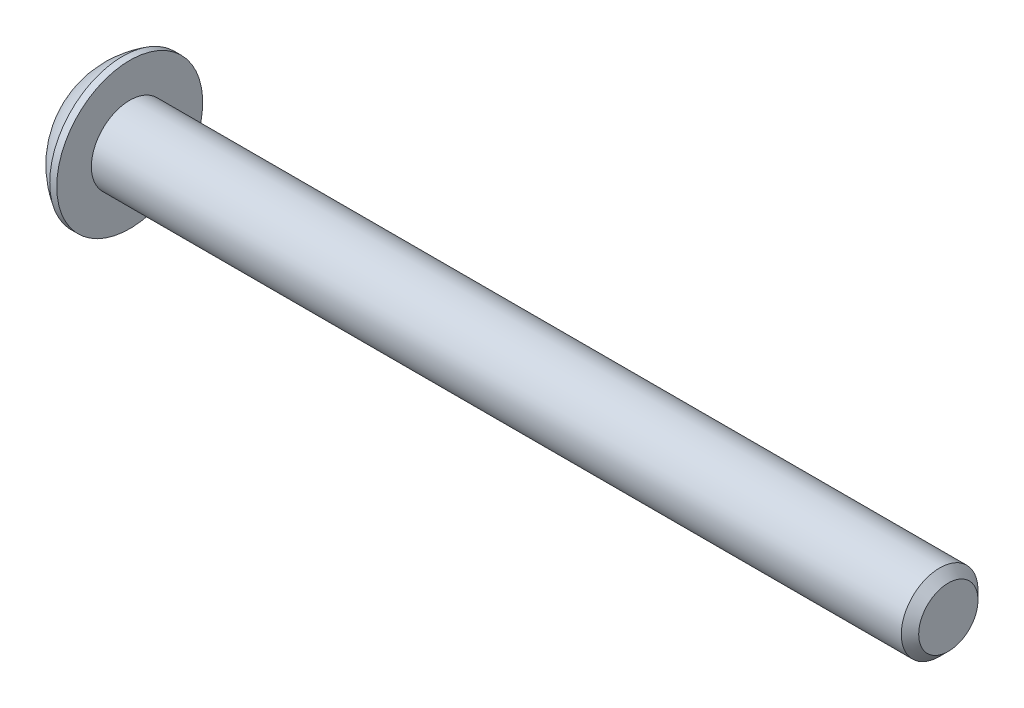
ISO-10303-21;
HEADER;
FILE_DESCRIPTION(('STEP AP214'),'2;1');
FILE_NAME('part.step','',(''),(''),'','','');
FILE_SCHEMA(('AUTOMOTIVE_DESIGN { 1 0 10303 214 1 1 1 1 }'));
ENDSEC;
DATA;
#1=APPLICATION_CONTEXT('core data for automotive mechanical design processes');
#2=APPLICATION_PROTOCOL_DEFINITION('international standard','automotive_design',2000,#1);
#3=PRODUCT_CONTEXT('',#1,'mechanical');
#4=PRODUCT('Part','Part','',(#3));
#5=PRODUCT_RELATED_PRODUCT_CATEGORY('part','',(#4));
#6=PRODUCT_DEFINITION_FORMATION('','',#4);
#7=PRODUCT_DEFINITION_CONTEXT('part definition',#1,'design');
#8=PRODUCT_DEFINITION('design','',#6,#7);
#9=PRODUCT_DEFINITION_SHAPE('','',#8);
#10=(LENGTH_UNIT() NAMED_UNIT(*) SI_UNIT(.MILLI.,.METRE.));
#11=(NAMED_UNIT(*) PLANE_ANGLE_UNIT() SI_UNIT($,.RADIAN.));
#12=(NAMED_UNIT(*) SI_UNIT($,.STERADIAN.) SOLID_ANGLE_UNIT());
#13=UNCERTAINTY_MEASURE_WITH_UNIT(LENGTH_MEASURE(1.E-05),#10,'distance_accuracy_value','');
#14=(GEOMETRIC_REPRESENTATION_CONTEXT(3) GLOBAL_UNCERTAINTY_ASSIGNED_CONTEXT((#13)) GLOBAL_UNIT_ASSIGNED_CONTEXT((#10,
#11,#12)) REPRESENTATION_CONTEXT('',''));
#15=CARTESIAN_POINT('',(0.,0.,0.));
#16=DIRECTION('',(0.,0.,1.));
#17=DIRECTION('',(1.,0.,0.));
#18=AXIS2_PLACEMENT_3D('',#15,#16,#17);
#19=CARTESIAN_POINT('',(1.32080000000034,0.,0.));
#20=DIRECTION('',(-1.,0.,0.));
#21=DIRECTION('',(0.,0.,1.));
#22=AXIS2_PLACEMENT_3D('',#19,#20,#21);
#23=CONICAL_SURFACE('',#22,1.1937999999998,1.04719755119608);
#24=CARTESIAN_POINT('',(2.01004075135902,0.,4.44089209850063E-13));
#25=VERTEX_POINT('',#24);
#26=VERTEX_LOOP('',#25);
#27=FACE_BOUND('',#26,.T.);
#28=CARTESIAN_POINT('',(1.32080000000009,0.,0.));
#29=DIRECTION('',(-1.,0.,0.));
#30=DIRECTION('',(0.,0.,1.));
#31=AXIS2_PLACEMENT_3D('',#28,#29,#30);
#32=CIRCLE('',#31,1.19380000000024);
#33=CARTESIAN_POINT('',(1.32080000000004,-1.03386112703797,0.596900000000061));
#34=VERTEX_POINT('',#33);
#35=CARTESIAN_POINT('',(1.32080000000004,0.,1.19380000000012));
#36=VERTEX_POINT('',#35);
#37=EDGE_CURVE('E19',#34,#36,#32,.T.);
#38=ORIENTED_EDGE('',*,*,#37,.T.);
#39=CARTESIAN_POINT('',(1.32080000000009,0.,0.));
#40=DIRECTION('',(-1.,0.,0.));
#41=DIRECTION('',(0.,0.,1.));
#42=AXIS2_PLACEMENT_3D('',#39,#40,#41);
#43=CIRCLE('',#42,1.19380000000024);
#44=CARTESIAN_POINT('',(1.32080000000004,1.03386112703797,0.59690000000006));
#45=VERTEX_POINT('',#44);
#46=EDGE_CURVE('E147',#36,#45,#43,.T.);
#47=ORIENTED_EDGE('',*,*,#46,.T.);
#48=CARTESIAN_POINT('',(1.32080000000009,0.,0.));
#49=DIRECTION('',(-1.,0.,0.));
#50=DIRECTION('',(0.,0.,1.));
#51=AXIS2_PLACEMENT_3D('',#48,#49,#50);
#52=CIRCLE('',#51,1.19380000000024);
#53=CARTESIAN_POINT('',(1.32080000000004,1.03386112703797,-0.59690000000006));
#54=VERTEX_POINT('',#53);
#55=EDGE_CURVE('E449',#45,#54,#52,.T.);
#56=ORIENTED_EDGE('',*,*,#55,.T.);
#57=CARTESIAN_POINT('',(1.32080000000009,0.,0.));
#58=DIRECTION('',(-1.,0.,0.));
#59=DIRECTION('',(0.,0.,1.));
#60=AXIS2_PLACEMENT_3D('',#57,#58,#59);
#61=CIRCLE('',#60,1.19380000000024);
#62=CARTESIAN_POINT('',(1.32080000000004,1.49457637585666E-12,-1.19380000000012));
#63=VERTEX_POINT('',#62);
#64=EDGE_CURVE('E450',#54,#63,#61,.T.);
#65=ORIENTED_EDGE('',*,*,#64,.T.);
#66=CARTESIAN_POINT('',(1.32080000000009,0.,0.));
#67=DIRECTION('',(-1.,0.,0.));
#68=DIRECTION('',(0.,0.,1.));
#69=AXIS2_PLACEMENT_3D('',#66,#67,#68);
#70=CIRCLE('',#69,1.19380000000024);
#71=CARTESIAN_POINT('',(1.32080000000004,-1.03386112703797,-0.596900000000061));
#72=VERTEX_POINT('',#71);
#73=EDGE_CURVE('E92',#63,#72,#70,.T.);
#74=ORIENTED_EDGE('',*,*,#73,.T.);
#75=CARTESIAN_POINT('',(1.32080000000009,0.,0.));
#76=DIRECTION('',(-1.,0.,0.));
#77=DIRECTION('',(0.,0.,1.));
#78=AXIS2_PLACEMENT_3D('',#75,#76,#77);
#79=CIRCLE('',#78,1.19380000000024);
#80=EDGE_CURVE('E88',#72,#34,#79,.T.);
#81=ORIENTED_EDGE('',*,*,#80,.T.);
#82=EDGE_LOOP('',(#38,#47,#56,#65,#74,#81));
#83=FACE_BOUND('',#82,.T.);
#84=ADVANCED_FACE('F16',(#27,#83),#23,.F.);
#85=CARTESIAN_POINT('',(1.3208,-2.06772225407573,-1.1938));
#86=DIRECTION('',(1.,0.,0.));
#87=DIRECTION('',(0.,0.,-1.));
#88=AXIS2_PLACEMENT_3D('',#85,#86,#87);
#89=PLANE('',#88);
#90=DIRECTION('',(0.,0.5,0.866025403784439));
#91=VECTOR('',#90,1.);
#92=CARTESIAN_POINT('',(1.3208,-1.37848150271715,0.));
#93=LINE('',#92,#91);
#94=CARTESIAN_POINT('',(1.3208,-0.689240751358575,1.1938));
#95=VERTEX_POINT('',#94);
#96=EDGE_CURVE('E100',#95,#34,#93,.F.);
#97=ORIENTED_EDGE('',*,*,#96,.F.);
#98=DIRECTION('',(0.,1.,0.));
#99=VECTOR('',#98,1.);
#100=CARTESIAN_POINT('',(1.3208,-0.689240751358575,1.1938));
#101=LINE('',#100,#99);
#102=EDGE_CURVE('E102',#36,#95,#101,.F.);
#103=ORIENTED_EDGE('',*,*,#102,.F.);
#104=ORIENTED_EDGE('',*,*,#37,.F.);
#105=EDGE_LOOP('',(#97,#103,#104));
#106=FACE_BOUND('',#105,.T.);
#107=ADVANCED_FACE('F98',(#106),#89,.F.);
#108=CARTESIAN_POINT('',(1.3208,-2.06772225407573,-1.1938));
#109=DIRECTION('',(1.,0.,0.));
#110=DIRECTION('',(0.,0.,-1.));
#111=AXIS2_PLACEMENT_3D('',#108,#109,#110);
#112=PLANE('',#111);
#113=DIRECTION('',(0.,-0.5,0.866025403784439));
#114=VECTOR('',#113,1.);
#115=CARTESIAN_POINT('',(1.3208,-0.689240751358575,-1.1938));
#116=LINE('',#115,#114);
#117=CARTESIAN_POINT('',(1.3208,-1.37848150271715,0.));
#118=VERTEX_POINT('',#117);
#119=EDGE_CURVE('E108',#118,#72,#116,.F.);
#120=ORIENTED_EDGE('',*,*,#119,.F.);
#121=DIRECTION('',(0.,0.5,0.866025403784439));
#122=VECTOR('',#121,1.);
#123=CARTESIAN_POINT('',(1.3208,-1.37848150271715,0.));
#124=LINE('',#123,#122);
#125=EDGE_CURVE('E105',#34,#118,#124,.F.);
#126=ORIENTED_EDGE('',*,*,#125,.F.);
#127=ORIENTED_EDGE('',*,*,#80,.F.);
#128=EDGE_LOOP('',(#120,#126,#127));
#129=FACE_BOUND('',#128,.T.);
#130=ADVANCED_FACE('F106',(#129),#112,.F.);
#131=CARTESIAN_POINT('',(1.3208,-2.06772225407573,-1.1938));
#132=DIRECTION('',(1.,0.,0.));
#133=DIRECTION('',(0.,0.,-1.));
#134=AXIS2_PLACEMENT_3D('',#131,#132,#133);
#135=PLANE('',#134);
#136=DIRECTION('',(0.,1.,0.));
#137=VECTOR('',#136,1.);
#138=CARTESIAN_POINT('',(1.3208,0.689240751358575,-1.1938));
#139=LINE('',#138,#137);
#140=CARTESIAN_POINT('',(1.3208,-0.689240751358575,-1.1938));
#141=VERTEX_POINT('',#140);
#142=EDGE_CURVE('E420',#141,#63,#139,.T.);
#143=ORIENTED_EDGE('',*,*,#142,.F.);
#144=DIRECTION('',(0.,-0.5,0.866025403784439));
#145=VECTOR('',#144,1.);
#146=CARTESIAN_POINT('',(1.3208,-0.689240751358575,-1.1938));
#147=LINE('',#146,#145);
#148=EDGE_CURVE('E432',#72,#141,#147,.F.);
#149=ORIENTED_EDGE('',*,*,#148,.F.);
#150=ORIENTED_EDGE('',*,*,#73,.F.);
#151=EDGE_LOOP('',(#143,#149,#150));
#152=FACE_BOUND('',#151,.T.);
#153=ADVANCED_FACE('F190',(#152),#135,.F.);
#154=CARTESIAN_POINT('',(1.3208,-2.06772225407573,-1.1938));
#155=DIRECTION('',(1.,0.,0.));
#156=DIRECTION('',(0.,0.,-1.));
#157=AXIS2_PLACEMENT_3D('',#154,#155,#156);
#158=PLANE('',#157);
#159=DIRECTION('',(0.,-0.499999999999999,-0.866025403784439));
#160=VECTOR('',#159,1.);
#161=CARTESIAN_POINT('',(1.3208,1.37848150271715,0.));
#162=LINE('',#161,#160);
#163=CARTESIAN_POINT('',(1.3208,0.689240751358575,-1.1938));
#164=VERTEX_POINT('',#163);
#165=EDGE_CURVE('E406',#164,#54,#162,.F.);
#166=ORIENTED_EDGE('',*,*,#165,.F.);
#167=DIRECTION('',(0.,1.,0.));
#168=VECTOR('',#167,1.);
#169=CARTESIAN_POINT('',(1.3208,0.689240751358575,-1.1938));
#170=LINE('',#169,#168);
#171=EDGE_CURVE('E417',#63,#164,#170,.T.);
#172=ORIENTED_EDGE('',*,*,#171,.F.);
#173=ORIENTED_EDGE('',*,*,#64,.F.);
#174=EDGE_LOOP('',(#166,#172,#173));
#175=FACE_BOUND('',#174,.T.);
#176=ADVANCED_FACE('F186',(#175),#158,.F.);
#177=CARTESIAN_POINT('',(1.3208,-2.06772225407573,-1.1938));
#178=DIRECTION('',(1.,0.,0.));
#179=DIRECTION('',(0.,0.,-1.));
#180=AXIS2_PLACEMENT_3D('',#177,#178,#179);
#181=PLANE('',#180);
#182=DIRECTION('',(0.,0.499999999999999,-0.866025403784439));
#183=VECTOR('',#182,1.);
#184=CARTESIAN_POINT('',(1.3208,0.689240751358575,1.1938));
#185=LINE('',#184,#183);
#186=CARTESIAN_POINT('',(1.3208,1.37848150271715,0.));
#187=VERTEX_POINT('',#186);
#188=EDGE_CURVE('E385',#187,#45,#185,.F.);
#189=ORIENTED_EDGE('',*,*,#188,.F.);
#190=DIRECTION('',(0.,-0.499999999999999,-0.866025403784439));
#191=VECTOR('',#190,1.);
#192=CARTESIAN_POINT('',(1.3208,1.37848150271715,0.));
#193=LINE('',#192,#191);
#194=EDGE_CURVE('E404',#54,#187,#193,.F.);
#195=ORIENTED_EDGE('',*,*,#194,.F.);
#196=ORIENTED_EDGE('',*,*,#55,.F.);
#197=EDGE_LOOP('',(#189,#195,#196));
#198=FACE_BOUND('',#197,.T.);
#199=ADVANCED_FACE('F182',(#198),#181,.F.);
#200=CARTESIAN_POINT('',(1.3208,-2.06772225407573,-1.1938));
#201=DIRECTION('',(1.,0.,0.));
#202=DIRECTION('',(0.,0.,-1.));
#203=AXIS2_PLACEMENT_3D('',#200,#201,#202);
#204=PLANE('',#203);
#205=DIRECTION('',(0.,1.,0.));
#206=VECTOR('',#205,1.);
#207=CARTESIAN_POINT('',(1.3208,-0.689240751358575,1.1938));
#208=LINE('',#207,#206);
#209=CARTESIAN_POINT('',(1.3208,0.689240751358575,1.1938));
#210=VERTEX_POINT('',#209);
#211=EDGE_CURVE('E117',#210,#36,#208,.F.);
#212=ORIENTED_EDGE('',*,*,#211,.F.);
#213=DIRECTION('',(0.,0.499999999999999,-0.866025403784439));
#214=VECTOR('',#213,1.);
#215=CARTESIAN_POINT('',(1.3208,0.689240751358575,1.1938));
#216=LINE('',#215,#214);
#217=EDGE_CURVE('E388',#45,#210,#216,.F.);
#218=ORIENTED_EDGE('',*,*,#217,.F.);
#219=ORIENTED_EDGE('',*,*,#46,.F.);
#220=EDGE_LOOP('',(#212,#218,#219));
#221=FACE_BOUND('',#220,.T.);
#222=ADVANCED_FACE('F178',(#221),#204,.F.);
#223=CARTESIAN_POINT('',(1.3208,-0.689240751358575,1.1938));
#224=DIRECTION('',(0.,0.,-1.));
#225=DIRECTION('',(0.,1.,0.));
#226=AXIS2_PLACEMENT_3D('',#223,#224,#225);
#227=PLANE('',#226);
#228=DIRECTION('',(0.,1.,0.));
#229=VECTOR('',#228,1.);
#230=CARTESIAN_POINT('',(0.,0.,1.1938));
#231=LINE('',#230,#229);
#232=CARTESIAN_POINT('',(0.,0.689240751358575,1.1938));
#233=VERTEX_POINT('',#232);
#234=CARTESIAN_POINT('',(0.,-0.689240751358575,1.1938));
#235=VERTEX_POINT('',#234);
#236=EDGE_CURVE('E382',#233,#235,#231,.F.);
#237=ORIENTED_EDGE('',*,*,#236,.F.);
#238=DIRECTION('',(1.,0.,0.));
#239=VECTOR('',#238,1.);
#240=CARTESIAN_POINT('',(1.3208,0.689240751358575,1.1938));
#241=LINE('',#240,#239);
#242=EDGE_CURVE('E394',#210,#233,#241,.F.);
#243=ORIENTED_EDGE('',*,*,#242,.F.);
#244=ORIENTED_EDGE('',*,*,#211,.T.);
#245=ORIENTED_EDGE('',*,*,#102,.T.);
#246=DIRECTION('',(1.,0.,0.));
#247=VECTOR('',#246,1.);
#248=CARTESIAN_POINT('',(1.3208,-0.689240751358575,1.1938));
#249=LINE('',#248,#247);
#250=EDGE_CURVE('E111',#235,#95,#249,.T.);
#251=ORIENTED_EDGE('',*,*,#250,.F.);
#252=EDGE_LOOP('',(#237,#243,#244,#245,#251));
#253=FACE_BOUND('',#252,.T.);
#254=ADVANCED_FACE('F175',(#253),#227,.T.);
#255=CARTESIAN_POINT('',(1.3208,-1.37848150271715,0.));
#256=DIRECTION('',(0.,0.866025403784439,-0.5));
#257=DIRECTION('',(0.,0.5,0.866025403784439));
#258=AXIS2_PLACEMENT_3D('',#255,#256,#257);
#259=PLANE('',#258);
#260=DIRECTION('',(0.,-0.5,-0.866025403784439));
#261=VECTOR('',#260,1.);
#262=CARTESIAN_POINT('',(0.,-0.689240751358575,1.1938));
#263=LINE('',#262,#261);
#264=CARTESIAN_POINT('',(0.,-1.37848150271715,0.));
#265=VERTEX_POINT('',#264);
#266=EDGE_CURVE('E379',#235,#265,#263,.T.);
#267=ORIENTED_EDGE('',*,*,#266,.F.);
#268=ORIENTED_EDGE('',*,*,#250,.T.);
#269=ORIENTED_EDGE('',*,*,#96,.T.);
#270=ORIENTED_EDGE('',*,*,#125,.T.);
#271=DIRECTION('',(1.,0.,0.));
#272=VECTOR('',#271,1.);
#273=CARTESIAN_POINT('',(1.3208,-1.37848150271715,0.));
#274=LINE('',#273,#272);
#275=EDGE_CURVE('E429',#265,#118,#274,.T.);
#276=ORIENTED_EDGE('',*,*,#275,.F.);
#277=EDGE_LOOP('',(#267,#268,#269,#270,#276));
#278=FACE_BOUND('',#277,.T.);
#279=ADVANCED_FACE('F115',(#278),#259,.T.);
#280=CARTESIAN_POINT('',(1.3208,-0.689240751358575,-1.1938));
#281=DIRECTION('',(0.,0.866025403784439,0.5));
#282=DIRECTION('',(0.,-0.5,0.866025403784439));
#283=AXIS2_PLACEMENT_3D('',#280,#281,#282);
#284=PLANE('',#283);
#285=DIRECTION('',(0.,0.5,-0.866025403784439));
#286=VECTOR('',#285,1.);
#287=CARTESIAN_POINT('',(0.,-1.37848150271715,0.));
#288=LINE('',#287,#286);
#289=CARTESIAN_POINT('',(0.,-0.689240751358575,-1.1938));
#290=VERTEX_POINT('',#289);
#291=EDGE_CURVE('E376',#265,#290,#288,.T.);
#292=ORIENTED_EDGE('',*,*,#291,.F.);
#293=ORIENTED_EDGE('',*,*,#275,.T.);
#294=ORIENTED_EDGE('',*,*,#119,.T.);
#295=ORIENTED_EDGE('',*,*,#148,.T.);
#296=DIRECTION('',(1.,0.,0.));
#297=VECTOR('',#296,1.);
#298=CARTESIAN_POINT('',(1.3208,-0.689240751358575,-1.1938));
#299=LINE('',#298,#297);
#300=EDGE_CURVE('E414',#290,#141,#299,.T.);
#301=ORIENTED_EDGE('',*,*,#300,.F.);
#302=EDGE_LOOP('',(#292,#293,#294,#295,#301));
#303=FACE_BOUND('',#302,.T.);
#304=ADVANCED_FACE('F168',(#303),#284,.T.);
#305=CARTESIAN_POINT('',(1.3208,0.689240751358575,-1.1938));
#306=DIRECTION('',(0.,0.,1.));
#307=DIRECTION('',(1.,0.,0.));
#308=AXIS2_PLACEMENT_3D('',#305,#306,#307);
#309=PLANE('',#308);
#310=DIRECTION('',(0.,1.,0.));
#311=VECTOR('',#310,1.);
#312=CARTESIAN_POINT('',(0.,0.,-1.1938));
#313=LINE('',#312,#311);
#314=CARTESIAN_POINT('',(0.,0.689240751358575,-1.1938));
#315=VERTEX_POINT('',#314);
#316=EDGE_CURVE('E373',#290,#315,#313,.T.);
#317=ORIENTED_EDGE('',*,*,#316,.F.);
#318=ORIENTED_EDGE('',*,*,#300,.T.);
#319=ORIENTED_EDGE('',*,*,#142,.T.);
#320=ORIENTED_EDGE('',*,*,#171,.T.);
#321=DIRECTION('',(1.,0.,0.));
#322=VECTOR('',#321,1.);
#323=CARTESIAN_POINT('',(1.3208,0.689240751358575,-1.1938));
#324=LINE('',#323,#322);
#325=EDGE_CURVE('E389',#315,#164,#324,.T.);
#326=ORIENTED_EDGE('',*,*,#325,.F.);
#327=EDGE_LOOP('',(#317,#318,#319,#320,#326));
#328=FACE_BOUND('',#327,.T.);
#329=ADVANCED_FACE('F165',(#328),#309,.T.);
#330=CARTESIAN_POINT('',(1.3208,1.37848150271715,0.));
#331=DIRECTION('',(0.,-0.866025403784439,0.499999999999999));
#332=DIRECTION('',(0.,-0.499999999999999,-0.866025403784439));
#333=AXIS2_PLACEMENT_3D('',#330,#331,#332);
#334=PLANE('',#333);
#335=DIRECTION('',(0.,0.499999999999999,0.866025403784439));
#336=VECTOR('',#335,1.);
#337=CARTESIAN_POINT('',(0.,0.689240751358575,-1.1938));
#338=LINE('',#337,#336);
#339=CARTESIAN_POINT('',(0.,1.37848150271715,0.));
#340=VERTEX_POINT('',#339);
#341=EDGE_CURVE('E370',#315,#340,#338,.T.);
#342=ORIENTED_EDGE('',*,*,#341,.F.);
#343=ORIENTED_EDGE('',*,*,#325,.T.);
#344=ORIENTED_EDGE('',*,*,#165,.T.);
#345=ORIENTED_EDGE('',*,*,#194,.T.);
#346=DIRECTION('',(1.,0.,0.));
#347=VECTOR('',#346,1.);
#348=CARTESIAN_POINT('',(1.3208,1.37848150271715,0.));
#349=LINE('',#348,#347);
#350=EDGE_CURVE('E34',#340,#187,#349,.T.);
#351=ORIENTED_EDGE('',*,*,#350,.F.);
#352=EDGE_LOOP('',(#342,#343,#344,#345,#351));
#353=FACE_BOUND('',#352,.T.);
#354=ADVANCED_FACE('F161',(#353),#334,.T.);
#355=CARTESIAN_POINT('',(1.3208,0.689240751358575,1.1938));
#356=DIRECTION('',(0.,-0.866025403784439,-0.499999999999999));
#357=DIRECTION('',(0.,0.499999999999999,-0.866025403784439));
#358=AXIS2_PLACEMENT_3D('',#355,#356,#357);
#359=PLANE('',#358);
#360=DIRECTION('',(0.,-0.499999999999999,0.866025403784439));
#361=VECTOR('',#360,1.);
#362=CARTESIAN_POINT('',(0.,1.37848150271715,0.));
#363=LINE('',#362,#361);
#364=EDGE_CURVE('E146',#340,#233,#363,.T.);
#365=ORIENTED_EDGE('',*,*,#364,.F.);
#366=ORIENTED_EDGE('',*,*,#350,.T.);
#367=ORIENTED_EDGE('',*,*,#188,.T.);
#368=ORIENTED_EDGE('',*,*,#217,.T.);
#369=ORIENTED_EDGE('',*,*,#242,.T.);
#370=EDGE_LOOP('',(#365,#366,#367,#368,#369));
#371=FACE_BOUND('',#370,.T.);
#372=ADVANCED_FACE('F157',(#371),#359,.T.);
#373=CARTESIAN_POINT('',(0.,0.,0.));
#374=DIRECTION('',(-1.,0.,0.));
#375=DIRECTION('',(0.,0.,1.));
#376=AXIS2_PLACEMENT_3D('',#373,#374,#375);
#377=PLANE('',#376);
#378=ORIENTED_EDGE('',*,*,#341,.T.);
#379=ORIENTED_EDGE('',*,*,#364,.T.);
#380=ORIENTED_EDGE('',*,*,#236,.T.);
#381=ORIENTED_EDGE('',*,*,#266,.T.);
#382=ORIENTED_EDGE('',*,*,#291,.T.);
#383=ORIENTED_EDGE('',*,*,#316,.T.);
#384=EDGE_LOOP('',(#378,#379,#380,#381,#382,#383));
#385=FACE_BOUND('',#384,.T.);
#386=CARTESIAN_POINT('',(0.,1.9812,0.));
#387=CARTESIAN_POINT('',(0.,1.9811996664299,0.0556258831179427));
#388=CARTESIAN_POINT('',(0.,1.97885520380442,0.111261989398606));
#389=CARTESIAN_POINT('',(0.,1.96949260169541,0.222149719830457));
#390=CARTESIAN_POINT('',(0.,1.96247308239605,0.277401225602895));
#391=CARTESIAN_POINT('',(0.,1.94379192841038,0.387209508139748));
#392=CARTESIAN_POINT('',(-1.85684713606366E-13,1.93212292489526,0.441765039546365));
#393=CARTESIAN_POINT('',(1.86703426467969E-13,1.90422331175315,0.549729449347493));
#394=CARTESIAN_POINT('',(6.95912300261454E-13,1.88798900035338,0.60313735920887));
#395=CARTESIAN_POINT('',(1.15748432216766E-12,1.83266214476501,0.760839131321829));
#396=CARTESIAN_POINT('',(0.,1.78690023648845,0.862876433575429));
#397=CARTESIAN_POINT('',(0.,1.67887358150667,1.05780719540872));
#398=CARTESIAN_POINT('',(9.54133844997183E-13,1.6166082074585,1.15070030720801));
#399=CARTESIAN_POINT('',(5.94835315740768E-13,1.51224157140982,1.28116890915698));
#400=CARTESIAN_POINT('',(1.63152335675163E-13,1.4755970394354,1.32320451127027));
#401=CARTESIAN_POINT('',(-1.62128088646011E-13,1.39893832619713,1.40400288695709));
#402=CARTESIAN_POINT('',(0.,1.35892742784699,1.44276877695455));
#403=CARTESIAN_POINT('',(1.13752532132066E-13,1.23416504602197,1.55382272417904));
#404=CARTESIAN_POINT('',(0.,1.14466125559859,1.62089527952111));
#405=CARTESIAN_POINT('',(0.,0.95571214417816,1.73902218081179));
#406=CARTESIAN_POINT('',(0.,0.856267198233559,1.79007713076007));
#407=CARTESIAN_POINT('',(0.,0.650206345910839,1.87477637530954));
#408=CARTESIAN_POINT('',(0.,0.543590516134851,1.90842085586267));
#409=CARTESIAN_POINT('',(0.,0.326226155292014,1.95733039300656));
#410=CARTESIAN_POINT('',(0.,0.215477602157926,1.97259535144288));
#411=CARTESIAN_POINT('',(0.,-0.00701040587545038,1.98431697865418));
#412=CARTESIAN_POINT('',(0.,-0.118749860774738,1.98077364742917));
#413=CARTESIAN_POINT('',(0.,-0.340050178355489,1.95497485623825));
#414=CARTESIAN_POINT('',(0.,-0.449611052668259,1.93271949620218));
#415=CARTESIAN_POINT('',(0.,-0.663431110729178,1.87014138774524));
#416=CARTESIAN_POINT('',(0.,-0.767690237838526,1.82981844635272));
#417=CARTESIAN_POINT('',(0.,-0.968005760719351,1.73219968377097));
#418=CARTESIAN_POINT('',(0.,-1.0640618469811,1.6749032225164));
#419=CARTESIAN_POINT('',(0.,-1.19980276751284,1.57757371205873));
#420=CARTESIAN_POINT('',(0.,-1.24366557129214,1.54322665019466));
#421=CARTESIAN_POINT('',(0.,-1.32838995706696,1.47093063174264));
#422=CARTESIAN_POINT('',(0.,-1.36924860178707,1.4329782310244));
#423=CARTESIAN_POINT('',(0.,-1.48674671849224,1.31419842051173));
#424=CARTESIAN_POINT('',(0.,-1.55842832343237,1.22836221289311));
#425=CARTESIAN_POINT('',(0.,-1.6863396856475,1.04586168272493));
#426=CARTESIAN_POINT('',(0.,-1.74257003024881,0.949197771949777));
#427=CARTESIAN_POINT('',(0.,-1.81416142504011,0.798182600298686));
#428=CARTESIAN_POINT('',(0.,-1.83591780585876,0.746776203847792));
#429=CARTESIAN_POINT('',(0.,-1.87500754181093,0.642341081688636));
#430=CARTESIAN_POINT('',(0.,-1.89234447645405,0.589313708122847));
#431=CARTESIAN_POINT('',(0.,-1.92246053433555,0.482076273028395));
#432=CARTESIAN_POINT('',(0.,-1.93524685475119,0.427868224257511));
#433=CARTESIAN_POINT('',(0.,-1.95620937250495,0.318578151844612));
#434=CARTESIAN_POINT('',(0.,-1.96438692958148,0.263496390912872));
#435=CARTESIAN_POINT('',(0.,-1.97388528284654,0.173607715038558));
#436=CARTESIAN_POINT('',(0.,-1.97662743364427,0.138944718024998));
#437=CARTESIAN_POINT('',(0.,-1.98028489645284,0.0695224782567004));
#438=CARTESIAN_POINT('',(0.,-1.98120020846368,0.0347632355019632));
#439=CARTESIAN_POINT('',(0.,-1.98119966642991,-0.0556258831179439));
#440=CARTESIAN_POINT('',(0.,-1.97885520380443,-0.111261989398607));
#441=CARTESIAN_POINT('',(0.,-1.96949260169542,-0.222149719830459));
#442=CARTESIAN_POINT('',(0.,-1.96247308239606,-0.277401225602897));
#443=CARTESIAN_POINT('',(0.,-1.9437919284104,-0.387209508139749));
#444=CARTESIAN_POINT('',(-1.85663518818529E-13,-1.93212292489527,-0.441765039546366));
#445=CARTESIAN_POINT('',(1.8668221444457E-13,-1.90422331175316,-0.549729449347494));
#446=CARTESIAN_POINT('',(6.95851299742614E-13,-1.88798900035339,-0.603137359208871));
#447=CARTESIAN_POINT('',(1.15760603242308E-12,-1.83266214476502,-0.76083913132183));
#448=CARTESIAN_POINT('',(0.,-1.78690023648846,-0.86287643357543));
#449=CARTESIAN_POINT('',(0.,-1.67887358150668,-1.05780719540872));
#450=CARTESIAN_POINT('',(9.51676789209375E-13,-1.61660820745851,-1.15070030720801));
#451=CARTESIAN_POINT('',(5.93462231683297E-13,-1.51224157140983,-1.28116890915698));
#452=CARTESIAN_POINT('',(1.62776229463016E-13,-1.47559703943541,-1.32320451127027));
#453=CARTESIAN_POINT('',(-1.61752345056899E-13,-1.39893832619714,-1.40400288695709));
#454=CARTESIAN_POINT('',(0.,-1.35892742784699,-1.44276877695455));
#455=CARTESIAN_POINT('',(1.13488992312735E-13,-1.23416504602198,-1.55382272417904));
#456=CARTESIAN_POINT('',(0.,-1.1446612555986,-1.62089527952111));
#457=CARTESIAN_POINT('',(0.,-0.955712144178172,-1.7390221808118));
#458=CARTESIAN_POINT('',(0.,-0.856267198233569,-1.79007713076007));
#459=CARTESIAN_POINT('',(0.,-0.650206345910848,-1.87477637530954));
#460=CARTESIAN_POINT('',(0.,-0.54359051613486,-1.90842085586267));
#461=CARTESIAN_POINT('',(0.,-0.326226155292023,-1.95733039300656));
#462=CARTESIAN_POINT('',(0.,-0.215477602157935,-1.97259535144288));
#463=CARTESIAN_POINT('',(0.,0.00701040587544162,-1.98431697865418));
#464=CARTESIAN_POINT('',(0.,0.118749860774729,-1.98077364742916));
#465=CARTESIAN_POINT('',(0.,0.340050178355481,-1.95497485623824));
#466=CARTESIAN_POINT('',(0.,0.449611052668251,-1.93271949620218));
#467=CARTESIAN_POINT('',(0.,0.663431110729171,-1.87014138774524));
#468=CARTESIAN_POINT('',(0.,0.767690237838518,-1.82981844635273));
#469=CARTESIAN_POINT('',(0.,0.968005760719342,-1.73219968377097));
#470=CARTESIAN_POINT('',(0.,1.06406184698109,-1.6749032225164));
#471=CARTESIAN_POINT('',(0.,1.19980276751283,-1.57757371205873));
#472=CARTESIAN_POINT('',(0.,1.24366557129213,-1.54322665019466));
#473=CARTESIAN_POINT('',(0.,1.32838995706696,-1.47093063174264));
#474=CARTESIAN_POINT('',(0.,1.36924860178706,-1.4329782310244));
#475=CARTESIAN_POINT('',(0.,1.48674671849222,-1.31419842051173));
#476=CARTESIAN_POINT('',(0.,1.55842832343237,-1.22836221289311));
#477=CARTESIAN_POINT('',(0.,1.6863396856475,-1.04586168272493));
#478=CARTESIAN_POINT('',(0.,1.74257003024879,-0.949197771949774));
#479=CARTESIAN_POINT('',(0.,1.8141614250401,-0.798182600298684));
#480=CARTESIAN_POINT('',(0.,1.83591780585875,-0.746776203847791));
#481=CARTESIAN_POINT('',(0.,1.87500754181092,-0.642341081688635));
#482=CARTESIAN_POINT('',(0.,1.89234447645404,-0.589313708122846));
#483=CARTESIAN_POINT('',(0.,1.92246053433554,-0.482076273028394));
#484=CARTESIAN_POINT('',(0.,1.93524685475117,-0.42786822425751));
#485=CARTESIAN_POINT('',(0.,1.95620937250493,-0.318578151844611));
#486=CARTESIAN_POINT('',(0.,1.96438692958147,-0.263496390912871));
#487=CARTESIAN_POINT('',(0.,1.97388528284653,-0.173607715038558));
#488=CARTESIAN_POINT('',(0.,1.97662743364426,-0.138944718024998));
#489=CARTESIAN_POINT('',(0.,1.98028489645283,-0.0695224782567008));
#490=CARTESIAN_POINT('',(0.,1.98120020846367,-0.0347632355019639));
#491=CARTESIAN_POINT('',(0.,1.9812,0.));
#492=B_SPLINE_CURVE_WITH_KNOTS('',3,(#386,#387,#388,#389,#390,#391,#392,#393,#394,#395,#396,
#397,#398,#399,#400,#401,#402,#403,#404,#405,#406,#407,#408,#409,#410,#411,#412,#413,#414,#415,
#416,#417,#418,#419,#420,#421,#422,#423,#424,#425,#426,#427,#428,#429,#430,#431,#432,#433,#434,
#435,#436,#437,#438,#439,#440,#441,#442,#443,#444,#445,#446,#447,#448,#449,#450,#451,#452,#453,
#454,#455,#456,#457,#458,#459,#460,#461,#462,#463,#464,#465,#466,#467,#468,#469,#470,#471,#472,
#473,#474,#475,#476,#477,#478,#479,#480,#481,#482,#483,#484,#485,#486,#487,#488,#489,#490,#491),
.UNSPECIFIED.,.T.,.F.,(4,2,2,2,2,2,2,2,2,2,2,2,2,2,2,2,2,2,2,2,2,2,2,2,2,2,2,2,2,2,2,2,2,2,2,2,
2,2,2,2,2,2,2,2,2,2,2,2,2,2,2,2,4),(0.,0.166845646007828,0.333740557374255,0.500901034367693,
0.668197445942387,1.00199278686282,1.33580081809885,1.50292354032982,1.6698851310853,
2.00370118900129,2.33750465770544,2.67130456115909,3.00510624723801,3.33890793331696,
3.67270783677065,4.00651130547476,4.34032736339027,4.50728895414555,4.67441167637632,
5.0082197076126,5.34201504853333,5.50931146010828,5.67647193710192,5.84336684846845,
6.01021249447641,6.11448220058335,6.2187519066903,6.38559755269813,6.55249246406455,
6.71965294105799,6.88694935263269,7.22074469355312,7.55455272478916,7.72167544702012,
7.8886370377756,8.22245309569159,8.55625656439574,8.89005646784939,9.22385815392831,
9.55765984000726,9.89145974346095,10.2252632121651,10.5590792700806,10.7260408608358,
10.8931635830666,11.2269716143029,11.5607669552236,11.7280633667986,11.8952238437922,
12.0621187551587,12.2289644011667,12.3332341072736,12.4375038133806),.UNSPECIFIED.);
#493=CARTESIAN_POINT('',(0.,1.9812,0.));
#494=VERTEX_POINT('',#493);
#495=EDGE_CURVE('E139',#494,#494,#492,.T.);
#496=ORIENTED_EDGE('',*,*,#495,.F.);
#497=EDGE_LOOP('',(#496));
#498=FACE_BOUND('',#497,.T.);
#499=ADVANCED_FACE('F153',(#385,#498),#377,.T.);
#500=CARTESIAN_POINT('',(4.13385000000001,0.,0.));
#501=DIRECTION('',(0.,1.,0.));
#502=DIRECTION('',(1.,0.,0.));
#503=AXIS2_PLACEMENT_3D('',#500,#501,#502);
#504=SPHERICAL_SURFACE('',#503,4.5840887057844);
#505=CARTESIAN_POINT('',(1.8288,0.,0.));
#506=DIRECTION('',(-1.,0.,0.));
#507=DIRECTION('',(0.,0.,1.));
#508=AXIS2_PLACEMENT_3D('',#505,#506,#507);
#509=CIRCLE('',#508,3.9624);
#510=CARTESIAN_POINT('',(1.8288,0.,3.9624));
#511=VERTEX_POINT('',#510);
#512=EDGE_CURVE('E136',#511,#511,#509,.F.);
#513=ORIENTED_EDGE('',*,*,#512,.F.);
#514=EDGE_LOOP('',(#513));
#515=FACE_BOUND('',#514,.T.);
#516=ORIENTED_EDGE('',*,*,#495,.T.);
#517=EDGE_LOOP('',(#516));
#518=FACE_BOUND('',#517,.T.);
#519=ADVANCED_FACE('F149',(#515,#518),#504,.T.);
#520=CARTESIAN_POINT('',(46.6598,0.,0.));
#521=DIRECTION('',(-1.,0.,0.));
#522=DIRECTION('',(0.,0.,1.));
#523=AXIS2_PLACEMENT_3D('',#520,#521,#522);
#524=PLANE('',#523);
#525=CARTESIAN_POINT('',(46.6597999999294,0.,0.));
#526=DIRECTION('',(-1.,0.,0.));
#527=DIRECTION('',(0.,0.,1.));
#528=AXIS2_PLACEMENT_3D('',#525,#526,#527);
#529=CIRCLE('',#528,1.61036000002923);
#530=CARTESIAN_POINT('',(46.6597999999294,0.,1.61036000002923));
#531=VERTEX_POINT('',#530);
#532=EDGE_CURVE('E133',#531,#531,#529,.T.);
#533=ORIENTED_EDGE('',*,*,#532,.F.);
#534=EDGE_LOOP('',(#533));
#535=FACE_BOUND('',#534,.T.);
#536=ADVANCED_FACE('F220',(#535),#524,.F.);
#537=CARTESIAN_POINT('',(0.,0.,0.));
#538=DIRECTION('',(-1.,0.,0.));
#539=DIRECTION('',(0.,0.,1.));
#540=AXIS2_PLACEMENT_3D('',#537,#538,#539);
#541=CYLINDRICAL_SURFACE('',#540,3.9624);
#542=ORIENTED_EDGE('',*,*,#512,.T.);
#543=EDGE_LOOP('',(#542));
#544=FACE_BOUND('',#543,.T.);
#545=CARTESIAN_POINT('',(2.2098,0.,0.));
#546=DIRECTION('',(-1.,0.,0.));
#547=DIRECTION('',(0.,0.,1.));
#548=AXIS2_PLACEMENT_3D('',#545,#546,#547);
#549=CIRCLE('',#548,3.9624);
#550=CARTESIAN_POINT('',(2.2098,0.,3.9624));
#551=VERTEX_POINT('',#550);
#552=EDGE_CURVE('E130',#551,#551,#549,.T.);
#553=ORIENTED_EDGE('',*,*,#552,.T.);
#554=EDGE_LOOP('',(#553));
#555=FACE_BOUND('',#554,.T.);
#556=ADVANCED_FACE('F217',(#544,#555),#541,.T.);
#557=CARTESIAN_POINT('',(46.1873600001468,0.,0.));
#558=DIRECTION('',(-1.,0.,0.));
#559=DIRECTION('',(0.,0.,1.));
#560=AXIS2_PLACEMENT_3D('',#557,#558,#559);
#561=CONICAL_SURFACE('',#560,2.08279999986871,0.785398163457608);
#562=CARTESIAN_POINT('',(46.18736,0.,0.));
#563=DIRECTION('',(-1.,0.,0.));
#564=DIRECTION('',(0.,0.,1.));
#565=AXIS2_PLACEMENT_3D('',#562,#563,#564);
#566=CIRCLE('',#565,2.0828);
#567=CARTESIAN_POINT('',(46.18736,0.,2.0828));
#568=VERTEX_POINT('',#567);
#569=EDGE_CURVE('E25',#568,#568,#566,.T.);
#570=ORIENTED_EDGE('',*,*,#569,.F.);
#571=EDGE_LOOP('',(#570));
#572=FACE_BOUND('',#571,.T.);
#573=ORIENTED_EDGE('',*,*,#532,.T.);
#574=EDGE_LOOP('',(#573));
#575=FACE_BOUND('',#574,.T.);
#576=ADVANCED_FACE('F210',(#572,#575),#561,.T.);
#577=CARTESIAN_POINT('',(2.2098,2.08279999999999,0.));
#578=DIRECTION('',(-1.,0.,0.));
#579=DIRECTION('',(0.,0.,1.));
#580=AXIS2_PLACEMENT_3D('',#577,#578,#579);
#581=PLANE('',#580);
#582=CARTESIAN_POINT('',(2.2098,0.,0.));
#583=DIRECTION('',(-1.,0.,0.));
#584=DIRECTION('',(0.,0.,1.));
#585=AXIS2_PLACEMENT_3D('',#582,#583,#584);
#586=CIRCLE('',#585,2.0828);
#587=CARTESIAN_POINT('',(2.2098,0.,2.0828));
#588=VERTEX_POINT('',#587);
#589=EDGE_CURVE('E11',#588,#588,#586,.F.);
#590=ORIENTED_EDGE('',*,*,#589,.F.);
#591=EDGE_LOOP('',(#590));
#592=FACE_BOUND('',#591,.T.);
#593=ORIENTED_EDGE('',*,*,#552,.F.);
#594=EDGE_LOOP('',(#593));
#595=FACE_BOUND('',#594,.T.);
#596=ADVANCED_FACE('F204',(#592,#595),#581,.F.);
#597=CARTESIAN_POINT('',(0.,0.,0.));
#598=DIRECTION('',(-1.,0.,0.));
#599=DIRECTION('',(0.,0.,1.));
#600=AXIS2_PLACEMENT_3D('',#597,#598,#599);
#601=CYLINDRICAL_SURFACE('',#600,2.0828);
#602=ORIENTED_EDGE('',*,*,#589,.T.);
#603=EDGE_LOOP('',(#602));
#604=FACE_BOUND('',#603,.T.);
#605=ORIENTED_EDGE('',*,*,#569,.T.);
#606=EDGE_LOOP('',(#605));
#607=FACE_BOUND('',#606,.T.);
#608=ADVANCED_FACE('F202',(#604,#607),#601,.T.);
#609=CLOSED_SHELL('',(#84,#107,#130,#153,#176,#199,#222,#254,#279,#304,#329,#354,#372,#499,#519,
#536,#556,#576,#596,#608));
#610=MANIFOLD_SOLID_BREP('B1',#609);
#611=ADVANCED_BREP_SHAPE_REPRESENTATION('',(#18,#610),#14);
#612=SHAPE_DEFINITION_REPRESENTATION(#9,#611);
ENDSEC;
END-ISO-10303-21;
